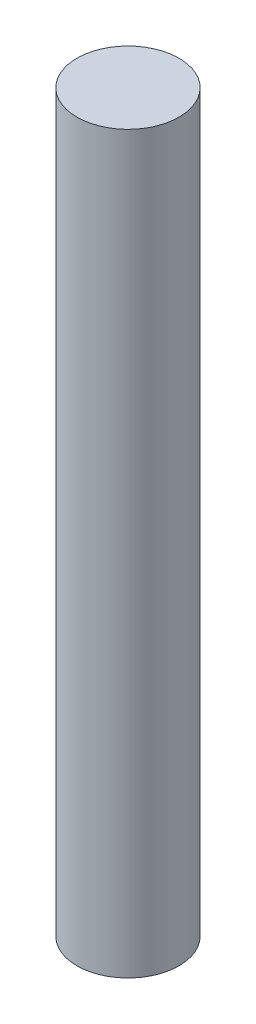
ISO-10303-21;
HEADER;
FILE_DESCRIPTION(('STEP AP214'),'2;1');
FILE_NAME('part.step','',(''),(''),'','','');
FILE_SCHEMA(('AUTOMOTIVE_DESIGN { 1 0 10303 214 1 1 1 1 }'));
ENDSEC;
DATA;
#1=APPLICATION_CONTEXT('core data for automotive mechanical design processes');
#2=APPLICATION_PROTOCOL_DEFINITION('international standard','automotive_design',2000,#1);
#3=PRODUCT_CONTEXT('',#1,'mechanical');
#4=PRODUCT('Part','Part','',(#3));
#5=PRODUCT_RELATED_PRODUCT_CATEGORY('part','',(#4));
#6=PRODUCT_DEFINITION_FORMATION('','',#4);
#7=PRODUCT_DEFINITION_CONTEXT('part definition',#1,'design');
#8=PRODUCT_DEFINITION('design','',#6,#7);
#9=PRODUCT_DEFINITION_SHAPE('','',#8);
#10=(LENGTH_UNIT() NAMED_UNIT(*) SI_UNIT(.MILLI.,.METRE.));
#11=(NAMED_UNIT(*) PLANE_ANGLE_UNIT() SI_UNIT($,.RADIAN.));
#12=(NAMED_UNIT(*) SI_UNIT($,.STERADIAN.) SOLID_ANGLE_UNIT());
#13=UNCERTAINTY_MEASURE_WITH_UNIT(LENGTH_MEASURE(1.E-05),#10,'distance_accuracy_value','');
#14=(GEOMETRIC_REPRESENTATION_CONTEXT(3) GLOBAL_UNCERTAINTY_ASSIGNED_CONTEXT((#13)) GLOBAL_UNIT_ASSIGNED_CONTEXT((#10,
#11,#12)) REPRESENTATION_CONTEXT('',''));
#15=CARTESIAN_POINT('',(0.,0.,0.));
#16=DIRECTION('',(0.,0.,1.));
#17=DIRECTION('',(1.,0.,0.));
#18=AXIS2_PLACEMENT_3D('',#15,#16,#17);
#19=CARTESIAN_POINT('',(0.,45.72,0.));
#20=DIRECTION('',(0.,-1.,0.));
#21=DIRECTION('',(0.,0.,-1.));
#22=AXIS2_PLACEMENT_3D('',#19,#20,#21);
#23=CYLINDRICAL_SURFACE('',#22,3.175);
#24=CARTESIAN_POINT('',(0.,45.72,0.));
#25=DIRECTION('',(0.,1.,0.));
#26=DIRECTION('',(0.,0.,1.));
#27=AXIS2_PLACEMENT_3D('',#24,#25,#26);
#28=CIRCLE('',#27,3.175);
#29=CARTESIAN_POINT('',(0.,45.72,3.175));
#30=VERTEX_POINT('',#29);
#31=EDGE_CURVE('E10',#30,#30,#28,.T.);
#32=ORIENTED_EDGE('',*,*,#31,.F.);
#33=EDGE_LOOP('',(#32));
#34=FACE_BOUND('',#33,.T.);
#35=CARTESIAN_POINT('',(0.,0.,0.));
#36=DIRECTION('',(0.,1.,0.));
#37=DIRECTION('',(0.,0.,1.));
#38=AXIS2_PLACEMENT_3D('',#35,#36,#37);
#39=CIRCLE('',#38,3.175);
#40=CARTESIAN_POINT('',(0.,0.,3.175));
#41=VERTEX_POINT('',#40);
#42=EDGE_CURVE('E44',#41,#41,#39,.T.);
#43=ORIENTED_EDGE('',*,*,#42,.T.);
#44=EDGE_LOOP('',(#43));
#45=FACE_BOUND('',#44,.T.);
#46=ADVANCED_FACE('F41',(#34,#45),#23,.T.);
#47=CARTESIAN_POINT('',(0.,45.72,0.));
#48=DIRECTION('',(0.,1.,0.));
#49=DIRECTION('',(0.,0.,1.));
#50=AXIS2_PLACEMENT_3D('',#47,#48,#49);
#51=PLANE('',#50);
#52=ORIENTED_EDGE('',*,*,#31,.T.);
#53=EDGE_LOOP('',(#52));
#54=FACE_BOUND('',#53,.T.);
#55=ADVANCED_FACE('F58',(#54),#51,.T.);
#56=CARTESIAN_POINT('',(0.,0.,0.));
#57=DIRECTION('',(0.,1.,0.));
#58=DIRECTION('',(0.,0.,1.));
#59=AXIS2_PLACEMENT_3D('',#56,#57,#58);
#60=PLANE('',#59);
#61=ORIENTED_EDGE('',*,*,#42,.F.);
#62=EDGE_LOOP('',(#61));
#63=FACE_BOUND('',#62,.T.);
#64=ADVANCED_FACE('F56',(#63),#60,.F.);
#65=CLOSED_SHELL('',(#46,#55,#64));
#66=MANIFOLD_SOLID_BREP('B2',#65);
#67=ADVANCED_BREP_SHAPE_REPRESENTATION('',(#18,#66),#14);
#68=SHAPE_DEFINITION_REPRESENTATION(#9,#67);
ENDSEC;
END-ISO-10303-21;
